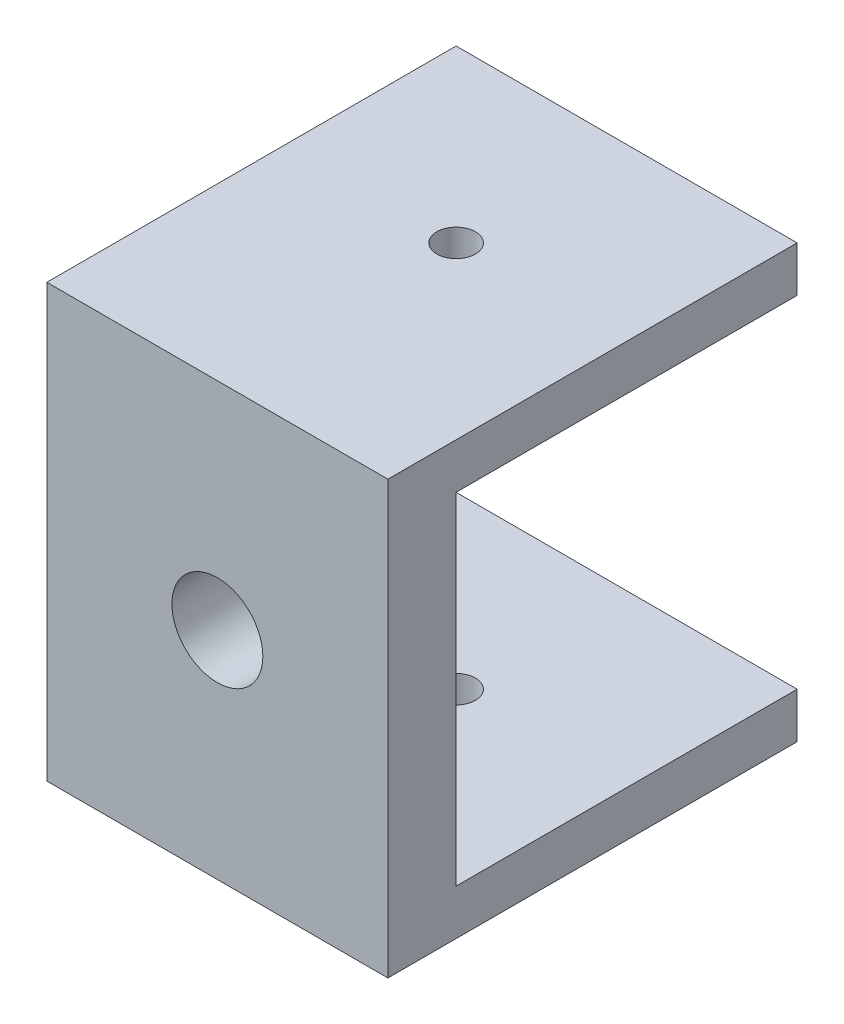
ISO-10303-21;
HEADER;
FILE_DESCRIPTION(('STEP AP214'),'2;1');
FILE_NAME('part.step','',(''),(''),'','','');
FILE_SCHEMA(('AUTOMOTIVE_DESIGN { 1 0 10303 214 1 1 1 1 }'));
ENDSEC;
DATA;
#1=APPLICATION_CONTEXT('core data for automotive mechanical design processes');
#2=APPLICATION_PROTOCOL_DEFINITION('international standard','automotive_design',2000,#1);
#3=PRODUCT_CONTEXT('',#1,'mechanical');
#4=PRODUCT('Part','Part','',(#3));
#5=PRODUCT_RELATED_PRODUCT_CATEGORY('part','',(#4));
#6=PRODUCT_DEFINITION_FORMATION('','',#4);
#7=PRODUCT_DEFINITION_CONTEXT('part definition',#1,'design');
#8=PRODUCT_DEFINITION('design','',#6,#7);
#9=PRODUCT_DEFINITION_SHAPE('','',#8);
#10=(LENGTH_UNIT() NAMED_UNIT(*) SI_UNIT(.MILLI.,.METRE.));
#11=(NAMED_UNIT(*) PLANE_ANGLE_UNIT() SI_UNIT($,.RADIAN.));
#12=(NAMED_UNIT(*) SI_UNIT($,.STERADIAN.) SOLID_ANGLE_UNIT());
#13=UNCERTAINTY_MEASURE_WITH_UNIT(LENGTH_MEASURE(1.E-05),#10,'distance_accuracy_value','');
#14=(GEOMETRIC_REPRESENTATION_CONTEXT(3) GLOBAL_UNCERTAINTY_ASSIGNED_CONTEXT((#13)) GLOBAL_UNIT_ASSIGNED_CONTEXT((#10,
#11,#12)) REPRESENTATION_CONTEXT('',''));
#15=CARTESIAN_POINT('',(0.,0.,0.));
#16=DIRECTION('',(0.,0.,1.));
#17=DIRECTION('',(1.,0.,0.));
#18=AXIS2_PLACEMENT_3D('',#15,#16,#17);
#19=CARTESIAN_POINT('',(30.,0.,-3.));
#20=DIRECTION('',(0.,0.,-1.));
#21=DIRECTION('',(0.,1.,0.));
#22=AXIS2_PLACEMENT_3D('',#19,#20,#21);
#23=PLANE('',#22);
#24=CARTESIAN_POINT('',(15.,0.,-3.));
#25=DIRECTION('',(0.,0.,-1.));
#26=DIRECTION('',(0.,1.,0.));
#27=AXIS2_PLACEMENT_3D('',#24,#25,#26);
#28=CIRCLE('',#27,4.);
#29=CARTESIAN_POINT('',(15.,4.,-3.));
#30=VERTEX_POINT('',#29);
#31=EDGE_CURVE('E138',#30,#30,#28,.T.);
#32=ORIENTED_EDGE('',*,*,#31,.F.);
#33=EDGE_LOOP('',(#32));
#34=FACE_BOUND('',#33,.T.);
#35=DIRECTION('',(0.,-1.,0.));
#36=VECTOR('',#35,1.);
#37=CARTESIAN_POINT('',(0.,0.,-3.));
#38=LINE('',#37,#36);
#39=CARTESIAN_POINT('',(0.,15.,-3.));
#40=VERTEX_POINT('',#39);
#41=CARTESIAN_POINT('',(0.,-15.,-3.));
#42=VERTEX_POINT('',#41);
#43=EDGE_CURVE('E135',#40,#42,#38,.T.);
#44=ORIENTED_EDGE('',*,*,#43,.F.);
#45=DIRECTION('',(-1.,0.,0.));
#46=VECTOR('',#45,1.);
#47=CARTESIAN_POINT('',(30.,15.,-3.));
#48=LINE('',#47,#46);
#49=CARTESIAN_POINT('',(30.,15.,-3.));
#50=VERTEX_POINT('',#49);
#51=EDGE_CURVE('E11',#50,#40,#48,.T.);
#52=ORIENTED_EDGE('',*,*,#51,.F.);
#53=DIRECTION('',(0.,-1.,0.));
#54=VECTOR('',#53,1.);
#55=CARTESIAN_POINT('',(30.,0.,-3.));
#56=LINE('',#55,#54);
#57=CARTESIAN_POINT('',(30.,-15.,-3.));
#58=VERTEX_POINT('',#57);
#59=EDGE_CURVE('E154',#50,#58,#56,.T.);
#60=ORIENTED_EDGE('',*,*,#59,.T.);
#61=DIRECTION('',(-1.,0.,0.));
#62=VECTOR('',#61,1.);
#63=CARTESIAN_POINT('',(30.,-15.,-3.));
#64=LINE('',#63,#62);
#65=EDGE_CURVE('E56',#58,#42,#64,.T.);
#66=ORIENTED_EDGE('',*,*,#65,.T.);
#67=EDGE_LOOP('',(#44,#52,#60,#66));
#68=FACE_BOUND('',#67,.T.);
#69=ADVANCED_FACE('F39',(#34,#68),#23,.T.);
#70=CARTESIAN_POINT('',(30.,15.,0.));
#71=DIRECTION('',(0.,1.,0.));
#72=DIRECTION('',(0.,0.,1.));
#73=AXIS2_PLACEMENT_3D('',#70,#71,#72);
#74=PLANE('',#73);
#75=CARTESIAN_POINT('',(15.,15.,-18.));
#76=DIRECTION('',(0.,1.,0.));
#77=DIRECTION('',(0.,0.,1.));
#78=AXIS2_PLACEMENT_3D('',#75,#76,#77);
#79=CIRCLE('',#78,1.7);
#80=CARTESIAN_POINT('',(15.,15.,-16.3));
#81=VERTEX_POINT('',#80);
#82=EDGE_CURVE('E191',#81,#81,#79,.T.);
#83=ORIENTED_EDGE('',*,*,#82,.T.);
#84=EDGE_LOOP('',(#83));
#85=FACE_BOUND('',#84,.T.);
#86=DIRECTION('',(0.,0.,-1.));
#87=VECTOR('',#86,1.);
#88=CARTESIAN_POINT('',(0.,15.,0.));
#89=LINE('',#88,#87);
#90=CARTESIAN_POINT('',(0.,15.,-33.));
#91=VERTEX_POINT('',#90);
#92=EDGE_CURVE('E137',#40,#91,#89,.T.);
#93=ORIENTED_EDGE('',*,*,#92,.T.);
#94=DIRECTION('',(-1.,0.,0.));
#95=VECTOR('',#94,1.);
#96=CARTESIAN_POINT('',(30.,15.,-33.));
#97=LINE('',#96,#95);
#98=CARTESIAN_POINT('',(30.,15.,-33.));
#99=VERTEX_POINT('',#98);
#100=EDGE_CURVE('E48',#99,#91,#97,.T.);
#101=ORIENTED_EDGE('',*,*,#100,.F.);
#102=DIRECTION('',(0.,0.,-1.));
#103=VECTOR('',#102,1.);
#104=CARTESIAN_POINT('',(30.,15.,0.));
#105=LINE('',#104,#103);
#106=EDGE_CURVE('E181',#50,#99,#105,.T.);
#107=ORIENTED_EDGE('',*,*,#106,.F.);
#108=ORIENTED_EDGE('',*,*,#51,.T.);
#109=EDGE_LOOP('',(#93,#101,#107,#108));
#110=FACE_BOUND('',#109,.T.);
#111=ADVANCED_FACE('F211',(#85,#110),#74,.F.);
#112=CARTESIAN_POINT('',(30.,0.,-33.));
#113=DIRECTION('',(0.,0.,1.));
#114=DIRECTION('',(1.,0.,0.));
#115=AXIS2_PLACEMENT_3D('',#112,#113,#114);
#116=PLANE('',#115);
#117=DIRECTION('',(0.,1.,0.));
#118=VECTOR('',#117,1.);
#119=CARTESIAN_POINT('',(0.,0.,-33.));
#120=LINE('',#119,#118);
#121=CARTESIAN_POINT('',(0.,19.,-33.));
#122=VERTEX_POINT('',#121);
#123=EDGE_CURVE('E140',#91,#122,#120,.T.);
#124=ORIENTED_EDGE('',*,*,#123,.T.);
#125=DIRECTION('',(-1.,0.,0.));
#126=VECTOR('',#125,1.);
#127=CARTESIAN_POINT('',(30.,19.,-33.));
#128=LINE('',#127,#126);
#129=CARTESIAN_POINT('',(30.,19.,-33.));
#130=VERTEX_POINT('',#129);
#131=EDGE_CURVE('E160',#130,#122,#128,.T.);
#132=ORIENTED_EDGE('',*,*,#131,.F.);
#133=DIRECTION('',(0.,1.,0.));
#134=VECTOR('',#133,1.);
#135=CARTESIAN_POINT('',(30.,0.,-33.));
#136=LINE('',#135,#134);
#137=EDGE_CURVE('E169',#99,#130,#136,.T.);
#138=ORIENTED_EDGE('',*,*,#137,.F.);
#139=ORIENTED_EDGE('',*,*,#100,.T.);
#140=EDGE_LOOP('',(#124,#132,#138,#139));
#141=FACE_BOUND('',#140,.T.);
#142=ADVANCED_FACE('F167',(#141),#116,.F.);
#143=CARTESIAN_POINT('',(30.,19.,0.));
#144=DIRECTION('',(0.,1.,0.));
#145=DIRECTION('',(0.,0.,1.));
#146=AXIS2_PLACEMENT_3D('',#143,#144,#145);
#147=PLANE('',#146);
#148=CARTESIAN_POINT('',(15.,19.,-18.));
#149=DIRECTION('',(0.,-1.,0.));
#150=DIRECTION('',(0.,0.,-1.));
#151=AXIS2_PLACEMENT_3D('',#148,#149,#150);
#152=CIRCLE('',#151,1.7);
#153=CARTESIAN_POINT('',(15.,19.,-19.7));
#154=VERTEX_POINT('',#153);
#155=EDGE_CURVE('E197',#154,#154,#152,.T.);
#156=ORIENTED_EDGE('',*,*,#155,.T.);
#157=EDGE_LOOP('',(#156));
#158=FACE_BOUND('',#157,.T.);
#159=DIRECTION('',(0.,0.,-1.));
#160=VECTOR('',#159,1.);
#161=CARTESIAN_POINT('',(0.,19.,0.));
#162=LINE('',#161,#160);
#163=CARTESIAN_POINT('',(0.,19.,3.));
#164=VERTEX_POINT('',#163);
#165=EDGE_CURVE('E143',#164,#122,#162,.T.);
#166=ORIENTED_EDGE('',*,*,#165,.F.);
#167=DIRECTION('',(-1.,0.,0.));
#168=VECTOR('',#167,1.);
#169=CARTESIAN_POINT('',(30.,19.,3.));
#170=LINE('',#169,#168);
#171=CARTESIAN_POINT('',(30.,19.,3.));
#172=VERTEX_POINT('',#171);
#173=EDGE_CURVE('E158',#172,#164,#170,.T.);
#174=ORIENTED_EDGE('',*,*,#173,.F.);
#175=DIRECTION('',(0.,0.,-1.));
#176=VECTOR('',#175,1.);
#177=CARTESIAN_POINT('',(30.,19.,0.));
#178=LINE('',#177,#176);
#179=EDGE_CURVE('E179',#172,#130,#178,.T.);
#180=ORIENTED_EDGE('',*,*,#179,.T.);
#181=ORIENTED_EDGE('',*,*,#131,.T.);
#182=EDGE_LOOP('',(#166,#174,#180,#181));
#183=FACE_BOUND('',#182,.T.);
#184=ADVANCED_FACE('F177',(#158,#183),#147,.T.);
#185=CARTESIAN_POINT('',(30.,0.,3.));
#186=DIRECTION('',(0.,0.,-1.));
#187=DIRECTION('',(0.,1.,0.));
#188=AXIS2_PLACEMENT_3D('',#185,#186,#187);
#189=PLANE('',#188);
#190=CARTESIAN_POINT('',(15.,0.,3.));
#191=DIRECTION('',(0.,0.,1.));
#192=DIRECTION('',(1.,0.,0.));
#193=AXIS2_PLACEMENT_3D('',#190,#191,#192);
#194=CIRCLE('',#193,4.);
#195=CARTESIAN_POINT('',(19.,0.,3.));
#196=VERTEX_POINT('',#195);
#197=EDGE_CURVE('E188',#196,#196,#194,.T.);
#198=ORIENTED_EDGE('',*,*,#197,.F.);
#199=EDGE_LOOP('',(#198));
#200=FACE_BOUND('',#199,.T.);
#201=DIRECTION('',(0.,-1.,0.));
#202=VECTOR('',#201,1.);
#203=CARTESIAN_POINT('',(0.,0.,3.));
#204=LINE('',#203,#202);
#205=CARTESIAN_POINT('',(0.,-19.,3.));
#206=VERTEX_POINT('',#205);
#207=EDGE_CURVE('E146',#164,#206,#204,.T.);
#208=ORIENTED_EDGE('',*,*,#207,.T.);
#209=DIRECTION('',(-1.,0.,0.));
#210=VECTOR('',#209,1.);
#211=CARTESIAN_POINT('',(30.,-19.,3.));
#212=LINE('',#211,#210);
#213=CARTESIAN_POINT('',(30.,-19.,3.));
#214=VERTEX_POINT('',#213);
#215=EDGE_CURVE('E127',#214,#206,#212,.T.);
#216=ORIENTED_EDGE('',*,*,#215,.F.);
#217=DIRECTION('',(0.,-1.,0.));
#218=VECTOR('',#217,1.);
#219=CARTESIAN_POINT('',(30.,0.,3.));
#220=LINE('',#219,#218);
#221=EDGE_CURVE('E115',#172,#214,#220,.T.);
#222=ORIENTED_EDGE('',*,*,#221,.F.);
#223=ORIENTED_EDGE('',*,*,#173,.T.);
#224=EDGE_LOOP('',(#208,#216,#222,#223));
#225=FACE_BOUND('',#224,.T.);
#226=ADVANCED_FACE('F225',(#200,#225),#189,.F.);
#227=CARTESIAN_POINT('',(30.,-19.,0.));
#228=DIRECTION('',(0.,1.,0.));
#229=DIRECTION('',(0.,0.,1.));
#230=AXIS2_PLACEMENT_3D('',#227,#228,#229);
#231=PLANE('',#230);
#232=CARTESIAN_POINT('',(15.,-19.,-18.));
#233=DIRECTION('',(0.,-1.,0.));
#234=DIRECTION('',(0.,0.,-1.));
#235=AXIS2_PLACEMENT_3D('',#232,#233,#234);
#236=CIRCLE('',#235,1.7);
#237=CARTESIAN_POINT('',(15.,-19.,-19.7));
#238=VERTEX_POINT('',#237);
#239=EDGE_CURVE('E194',#238,#238,#236,.T.);
#240=ORIENTED_EDGE('',*,*,#239,.F.);
#241=EDGE_LOOP('',(#240));
#242=FACE_BOUND('',#241,.T.);
#243=DIRECTION('',(0.,0.,-1.));
#244=VECTOR('',#243,1.);
#245=CARTESIAN_POINT('',(0.,-19.,0.));
#246=LINE('',#245,#244);
#247=CARTESIAN_POINT('',(0.,-19.,-33.));
#248=VERTEX_POINT('',#247);
#249=EDGE_CURVE('E124',#206,#248,#246,.T.);
#250=ORIENTED_EDGE('',*,*,#249,.T.);
#251=DIRECTION('',(-1.,0.,0.));
#252=VECTOR('',#251,1.);
#253=CARTESIAN_POINT('',(30.,-19.,-33.));
#254=LINE('',#253,#252);
#255=CARTESIAN_POINT('',(30.,-19.,-33.));
#256=VERTEX_POINT('',#255);
#257=EDGE_CURVE('E121',#256,#248,#254,.T.);
#258=ORIENTED_EDGE('',*,*,#257,.F.);
#259=DIRECTION('',(0.,0.,-1.));
#260=VECTOR('',#259,1.);
#261=CARTESIAN_POINT('',(30.,-19.,0.));
#262=LINE('',#261,#260);
#263=EDGE_CURVE('E106',#214,#256,#262,.T.);
#264=ORIENTED_EDGE('',*,*,#263,.F.);
#265=ORIENTED_EDGE('',*,*,#215,.T.);
#266=EDGE_LOOP('',(#250,#258,#264,#265));
#267=FACE_BOUND('',#266,.T.);
#268=ADVANCED_FACE('F122',(#242,#267),#231,.F.);
#269=CARTESIAN_POINT('',(30.,0.,-33.));
#270=DIRECTION('',(0.,0.,-1.));
#271=DIRECTION('',(-1.,0.,0.));
#272=AXIS2_PLACEMENT_3D('',#269,#270,#271);
#273=PLANE('',#272);
#274=DIRECTION('',(0.,-1.,0.));
#275=VECTOR('',#274,1.);
#276=CARTESIAN_POINT('',(0.,0.,-33.));
#277=LINE('',#276,#275);
#278=CARTESIAN_POINT('',(0.,-15.,-33.));
#279=VERTEX_POINT('',#278);
#280=EDGE_CURVE('E149',#279,#248,#277,.T.);
#281=ORIENTED_EDGE('',*,*,#280,.F.);
#282=DIRECTION('',(-1.,0.,0.));
#283=VECTOR('',#282,1.);
#284=CARTESIAN_POINT('',(30.,-15.,-33.));
#285=LINE('',#284,#283);
#286=CARTESIAN_POINT('',(30.,-15.,-33.));
#287=VERTEX_POINT('',#286);
#288=EDGE_CURVE('E81',#287,#279,#285,.T.);
#289=ORIENTED_EDGE('',*,*,#288,.F.);
#290=DIRECTION('',(0.,-1.,0.));
#291=VECTOR('',#290,1.);
#292=CARTESIAN_POINT('',(30.,0.,-33.));
#293=LINE('',#292,#291);
#294=EDGE_CURVE('E112',#287,#256,#293,.T.);
#295=ORIENTED_EDGE('',*,*,#294,.T.);
#296=ORIENTED_EDGE('',*,*,#257,.T.);
#297=EDGE_LOOP('',(#281,#289,#295,#296));
#298=FACE_BOUND('',#297,.T.);
#299=ADVANCED_FACE('F129',(#298),#273,.T.);
#300=CARTESIAN_POINT('',(30.,-15.,0.));
#301=DIRECTION('',(0.,1.,0.));
#302=DIRECTION('',(0.,0.,1.));
#303=AXIS2_PLACEMENT_3D('',#300,#301,#302);
#304=PLANE('',#303);
#305=CARTESIAN_POINT('',(15.,-15.,-18.));
#306=DIRECTION('',(0.,1.,0.));
#307=DIRECTION('',(0.,0.,1.));
#308=AXIS2_PLACEMENT_3D('',#305,#306,#307);
#309=CIRCLE('',#308,1.7);
#310=CARTESIAN_POINT('',(15.,-15.,-16.3));
#311=VERTEX_POINT('',#310);
#312=EDGE_CURVE('E42',#311,#311,#309,.T.);
#313=ORIENTED_EDGE('',*,*,#312,.F.);
#314=EDGE_LOOP('',(#313));
#315=FACE_BOUND('',#314,.T.);
#316=DIRECTION('',(0.,0.,-1.));
#317=VECTOR('',#316,1.);
#318=CARTESIAN_POINT('',(0.,-15.,0.));
#319=LINE('',#318,#317);
#320=EDGE_CURVE('E151',#42,#279,#319,.T.);
#321=ORIENTED_EDGE('',*,*,#320,.F.);
#322=ORIENTED_EDGE('',*,*,#65,.F.);
#323=DIRECTION('',(0.,0.,-1.));
#324=VECTOR('',#323,1.);
#325=CARTESIAN_POINT('',(30.,-15.,0.));
#326=LINE('',#325,#324);
#327=EDGE_CURVE('E130',#58,#287,#326,.T.);
#328=ORIENTED_EDGE('',*,*,#327,.T.);
#329=ORIENTED_EDGE('',*,*,#288,.T.);
#330=EDGE_LOOP('',(#321,#322,#328,#329));
#331=FACE_BOUND('',#330,.T.);
#332=ADVANCED_FACE('F207',(#315,#331),#304,.T.);
#333=CARTESIAN_POINT('',(30.,0.,0.));
#334=DIRECTION('',(1.,0.,0.));
#335=DIRECTION('',(0.,0.,-1.));
#336=AXIS2_PLACEMENT_3D('',#333,#334,#335);
#337=PLANE('',#336);
#338=ORIENTED_EDGE('',*,*,#59,.F.);
#339=ORIENTED_EDGE('',*,*,#106,.T.);
#340=ORIENTED_EDGE('',*,*,#137,.T.);
#341=ORIENTED_EDGE('',*,*,#179,.F.);
#342=ORIENTED_EDGE('',*,*,#221,.T.);
#343=ORIENTED_EDGE('',*,*,#263,.T.);
#344=ORIENTED_EDGE('',*,*,#294,.F.);
#345=ORIENTED_EDGE('',*,*,#327,.F.);
#346=EDGE_LOOP('',(#338,#339,#340,#341,#342,#343,#344,#345));
#347=FACE_BOUND('',#346,.T.);
#348=ADVANCED_FACE('F109',(#347),#337,.T.);
#349=CARTESIAN_POINT('',(0.,0.,0.));
#350=DIRECTION('',(1.,0.,0.));
#351=DIRECTION('',(0.,0.,-1.));
#352=AXIS2_PLACEMENT_3D('',#349,#350,#351);
#353=PLANE('',#352);
#354=ORIENTED_EDGE('',*,*,#43,.T.);
#355=ORIENTED_EDGE('',*,*,#320,.T.);
#356=ORIENTED_EDGE('',*,*,#280,.T.);
#357=ORIENTED_EDGE('',*,*,#249,.F.);
#358=ORIENTED_EDGE('',*,*,#207,.F.);
#359=ORIENTED_EDGE('',*,*,#165,.T.);
#360=ORIENTED_EDGE('',*,*,#123,.F.);
#361=ORIENTED_EDGE('',*,*,#92,.F.);
#362=EDGE_LOOP('',(#354,#355,#356,#357,#358,#359,#360,#361));
#363=FACE_BOUND('',#362,.T.);
#364=ADVANCED_FACE('F173',(#363),#353,.F.);
#365=CARTESIAN_POINT('',(15.,0.,-27.));
#366=DIRECTION('',(0.,0.,1.));
#367=DIRECTION('',(1.,0.,0.));
#368=AXIS2_PLACEMENT_3D('',#365,#366,#367);
#369=CYLINDRICAL_SURFACE('',#368,4.);
#370=ORIENTED_EDGE('',*,*,#31,.T.);
#371=EDGE_LOOP('',(#370));
#372=FACE_BOUND('',#371,.T.);
#373=ORIENTED_EDGE('',*,*,#197,.T.);
#374=EDGE_LOOP('',(#373));
#375=FACE_BOUND('',#374,.T.);
#376=ADVANCED_FACE('F219',(#372,#375),#369,.F.);
#377=CARTESIAN_POINT('',(15.,19.,-18.));
#378=DIRECTION('',(0.,-1.,0.));
#379=DIRECTION('',(0.,0.,-1.));
#380=AXIS2_PLACEMENT_3D('',#377,#378,#379);
#381=CYLINDRICAL_SURFACE('',#380,1.7);
#382=ORIENTED_EDGE('',*,*,#312,.T.);
#383=EDGE_LOOP('',(#382));
#384=FACE_BOUND('',#383,.T.);
#385=ORIENTED_EDGE('',*,*,#239,.T.);
#386=EDGE_LOOP('',(#385));
#387=FACE_BOUND('',#386,.T.);
#388=ADVANCED_FACE('F204',(#384,#387),#381,.F.);
#389=ORIENTED_EDGE('',*,*,#155,.F.);
#390=EDGE_LOOP('',(#389));
#391=FACE_BOUND('',#390,.T.);
#392=ORIENTED_EDGE('',*,*,#82,.F.);
#393=EDGE_LOOP('',(#392));
#394=FACE_BOUND('',#393,.T.);
#395=ADVANCED_FACE('F281',(#391,#394),#381,.F.);
#396=CLOSED_SHELL('',(#69,#111,#142,#184,#226,#268,#299,#332,#348,#364,#376,#388,#395));
#397=MANIFOLD_SOLID_BREP('B2',#396);
#398=ADVANCED_BREP_SHAPE_REPRESENTATION('',(#18,#397),#14);
#399=SHAPE_DEFINITION_REPRESENTATION(#9,#398);
ENDSEC;
END-ISO-10303-21;
